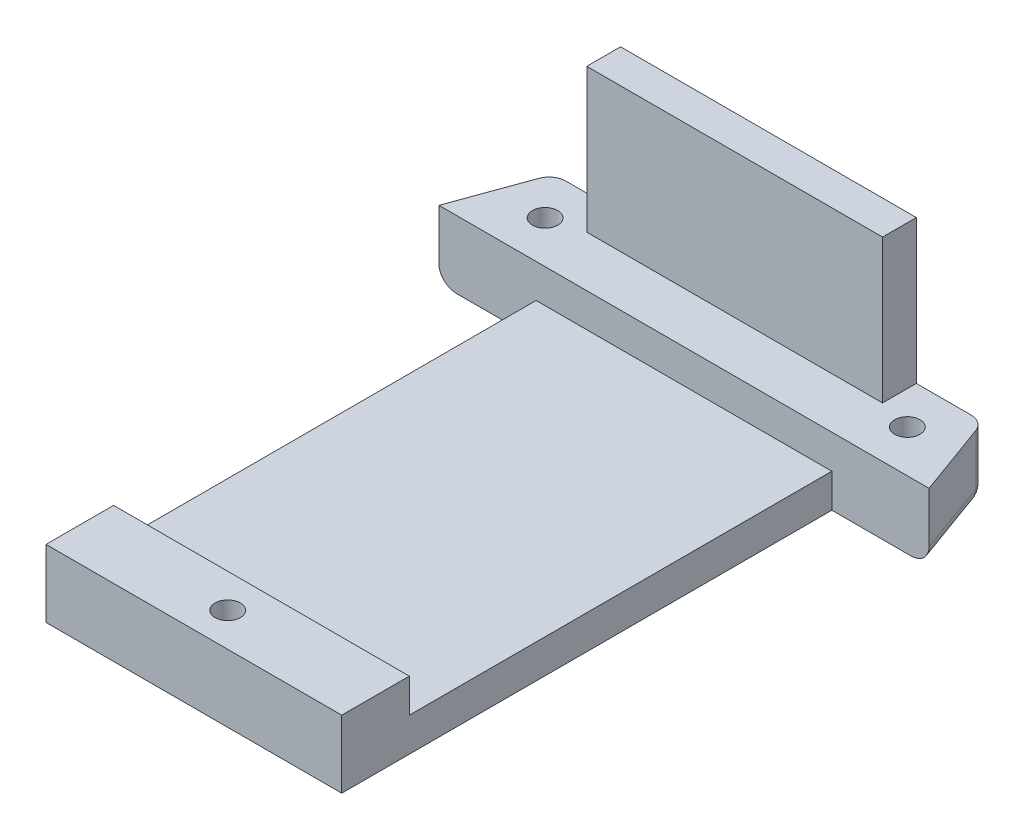
ISO-10303-21;
HEADER;
FILE_DESCRIPTION(('STEP AP214'),'2;1');
FILE_NAME('part.step','',(''),(''),'','','');
FILE_SCHEMA(('AUTOMOTIVE_DESIGN { 1 0 10303 214 1 1 1 1 }'));
ENDSEC;
DATA;
#1=APPLICATION_CONTEXT('core data for automotive mechanical design processes');
#2=APPLICATION_PROTOCOL_DEFINITION('international standard','automotive_design',2000,#1);
#3=PRODUCT_CONTEXT('',#1,'mechanical');
#4=PRODUCT('Part','Part','',(#3));
#5=PRODUCT_RELATED_PRODUCT_CATEGORY('part','',(#4));
#6=PRODUCT_DEFINITION_FORMATION('','',#4);
#7=PRODUCT_DEFINITION_CONTEXT('part definition',#1,'design');
#8=PRODUCT_DEFINITION('design','',#6,#7);
#9=PRODUCT_DEFINITION_SHAPE('','',#8);
#10=(LENGTH_UNIT() NAMED_UNIT(*) SI_UNIT(.MILLI.,.METRE.));
#11=(NAMED_UNIT(*) PLANE_ANGLE_UNIT() SI_UNIT($,.RADIAN.));
#12=(NAMED_UNIT(*) SI_UNIT($,.STERADIAN.) SOLID_ANGLE_UNIT());
#13=UNCERTAINTY_MEASURE_WITH_UNIT(LENGTH_MEASURE(1.E-05),#10,'distance_accuracy_value','');
#14=(GEOMETRIC_REPRESENTATION_CONTEXT(3) GLOBAL_UNCERTAINTY_ASSIGNED_CONTEXT((#13)) GLOBAL_UNIT_ASSIGNED_CONTEXT((#10,
#11,#12)) REPRESENTATION_CONTEXT('',''));
#15=CARTESIAN_POINT('',(0.,0.,0.));
#16=DIRECTION('',(0.,0.,1.));
#17=DIRECTION('',(1.,0.,0.));
#18=AXIS2_PLACEMENT_3D('',#15,#16,#17);
#19=CARTESIAN_POINT('',(0.,8.,34.));
#20=DIRECTION('',(0.,-1.,0.));
#21=DIRECTION('',(0.,0.,-1.));
#22=AXIS2_PLACEMENT_3D('',#19,#20,#21);
#23=CYLINDRICAL_SURFACE('',#22,1.5);
#24=CARTESIAN_POINT('',(0.,8.,34.));
#25=DIRECTION('',(0.,1.,0.));
#26=DIRECTION('',(0.,0.,1.));
#27=AXIS2_PLACEMENT_3D('',#24,#25,#26);
#28=CIRCLE('',#27,1.5);
#29=CARTESIAN_POINT('',(0.,8.,35.5));
#30=VERTEX_POINT('',#29);
#31=EDGE_CURVE('E284',#30,#30,#28,.T.);
#32=ORIENTED_EDGE('',*,*,#31,.T.);
#33=EDGE_LOOP('',(#32));
#34=FACE_BOUND('',#33,.T.);
#35=CARTESIAN_POINT('',(0.,4.,34.));
#36=DIRECTION('',(0.,-1.,0.));
#37=DIRECTION('',(0.,0.,-1.));
#38=AXIS2_PLACEMENT_3D('',#35,#36,#37);
#39=CIRCLE('',#38,1.5);
#40=CARTESIAN_POINT('',(0.,4.,32.5));
#41=VERTEX_POINT('',#40);
#42=EDGE_CURVE('E341',#41,#41,#39,.T.);
#43=ORIENTED_EDGE('',*,*,#42,.T.);
#44=EDGE_LOOP('',(#43));
#45=FACE_BOUND('',#44,.T.);
#46=ADVANCED_FACE('F43',(#34,#45),#23,.F.);
#47=CARTESIAN_POINT('',(-21.4375,8.,-25.));
#48=DIRECTION('',(0.,-1.,0.));
#49=DIRECTION('',(0.,0.,-1.));
#50=AXIS2_PLACEMENT_3D('',#47,#48,#49);
#51=CYLINDRICAL_SURFACE('',#50,1.5);
#52=CARTESIAN_POINT('',(-21.4375,8.,-25.));
#53=DIRECTION('',(0.,1.,0.));
#54=DIRECTION('',(0.,0.,1.));
#55=AXIS2_PLACEMENT_3D('',#52,#53,#54);
#56=CIRCLE('',#55,1.5);
#57=CARTESIAN_POINT('',(-21.4375,8.,-23.5));
#58=VERTEX_POINT('',#57);
#59=EDGE_CURVE('E256',#58,#58,#56,.T.);
#60=ORIENTED_EDGE('',*,*,#59,.T.);
#61=EDGE_LOOP('',(#60));
#62=FACE_BOUND('',#61,.T.);
#63=CARTESIAN_POINT('',(-21.4375,4.,-25.));
#64=DIRECTION('',(0.,-1.,0.));
#65=DIRECTION('',(0.,0.,-1.));
#66=AXIS2_PLACEMENT_3D('',#63,#64,#65);
#67=CIRCLE('',#66,1.5);
#68=CARTESIAN_POINT('',(-21.4375,4.,-26.5));
#69=VERTEX_POINT('',#68);
#70=EDGE_CURVE('E336',#69,#69,#67,.T.);
#71=ORIENTED_EDGE('',*,*,#70,.T.);
#72=EDGE_LOOP('',(#71));
#73=FACE_BOUND('',#72,.T.);
#74=ADVANCED_FACE('F492',(#62,#73),#51,.F.);
#75=CARTESIAN_POINT('',(21.4375,8.,-25.));
#76=DIRECTION('',(0.,-1.,0.));
#77=DIRECTION('',(0.,0.,-1.));
#78=AXIS2_PLACEMENT_3D('',#75,#76,#77);
#79=CYLINDRICAL_SURFACE('',#78,1.50000000000001);
#80=CARTESIAN_POINT('',(21.4375,8.,-25.));
#81=DIRECTION('',(0.,1.,0.));
#82=DIRECTION('',(0.,0.,1.));
#83=AXIS2_PLACEMENT_3D('',#80,#81,#82);
#84=CIRCLE('',#83,1.50000000000001);
#85=CARTESIAN_POINT('',(21.4375,8.,-23.5));
#86=VERTEX_POINT('',#85);
#87=EDGE_CURVE('E288',#86,#86,#84,.F.);
#88=ORIENTED_EDGE('',*,*,#87,.F.);
#89=EDGE_LOOP('',(#88));
#90=FACE_BOUND('',#89,.T.);
#91=CARTESIAN_POINT('',(21.4375,4.,-25.));
#92=DIRECTION('',(0.,-1.,0.));
#93=DIRECTION('',(0.,0.,-1.));
#94=AXIS2_PLACEMENT_3D('',#91,#92,#93);
#95=CIRCLE('',#94,1.50000000000001);
#96=CARTESIAN_POINT('',(21.4375,4.,-26.5));
#97=VERTEX_POINT('',#96);
#98=EDGE_CURVE('E332',#97,#97,#95,.F.);
#99=ORIENTED_EDGE('',*,*,#98,.F.);
#100=EDGE_LOOP('',(#99));
#101=FACE_BOUND('',#100,.T.);
#102=ADVANCED_FACE('F521',(#90,#101),#79,.F.);
#103=CARTESIAN_POINT('',(0.,8.,0.));
#104=DIRECTION('',(0.,1.,0.));
#105=DIRECTION('',(0.,0.,1.));
#106=AXIS2_PLACEMENT_3D('',#103,#104,#105);
#107=PLANE('',#106);
#108=DIRECTION('',(-0.3407993236214,0.,-0.940136065162483));
#109=VECTOR('',#108,1.);
#110=CARTESIAN_POINT('',(32.0397735119459,8.,-11.6144178980804));
#111=LINE('',#110,#109);
#112=CARTESIAN_POINT('',(29.,8.,-20.));
#113=VERTEX_POINT('',#112);
#114=CARTESIAN_POINT('',(25.8529204903745,8.,-28.6815986472428));
#115=VERTEX_POINT('',#114);
#116=EDGE_CURVE('E277',#113,#115,#111,.T.);
#117=ORIENTED_EDGE('',*,*,#116,.T.);
#118=CARTESIAN_POINT('',(23.9726483600495,8.,-28.));
#119=DIRECTION('',(0.,1.,0.));
#120=DIRECTION('',(0.,0.,1.));
#121=AXIS2_PLACEMENT_3D('',#118,#119,#120);
#122=CIRCLE('',#121,2.);
#123=CARTESIAN_POINT('',(23.9726483600495,8.,-30.));
#124=VERTEX_POINT('',#123);
#125=EDGE_CURVE('E53',#115,#124,#122,.T.);
#126=ORIENTED_EDGE('',*,*,#125,.T.);
#127=DIRECTION('',(-1.,0.,0.));
#128=VECTOR('',#127,1.);
#129=CARTESIAN_POINT('',(0.,8.,-30.));
#130=LINE('',#129,#128);
#131=CARTESIAN_POINT('',(17.5,8.,-30.));
#132=VERTEX_POINT('',#131);
#133=EDGE_CURVE('E281',#124,#132,#130,.T.);
#134=ORIENTED_EDGE('',*,*,#133,.T.);
#135=DIRECTION('',(0.,0.,-1.));
#136=VECTOR('',#135,1.);
#137=CARTESIAN_POINT('',(17.5,8.,-26.));
#138=LINE('',#137,#136);
#139=CARTESIAN_POINT('',(17.5,8.,-26.));
#140=VERTEX_POINT('',#139);
#141=EDGE_CURVE('E233',#140,#132,#138,.T.);
#142=ORIENTED_EDGE('',*,*,#141,.F.);
#143=DIRECTION('',(1.,0.,0.));
#144=VECTOR('',#143,1.);
#145=CARTESIAN_POINT('',(-17.5,8.,-26.));
#146=LINE('',#145,#144);
#147=CARTESIAN_POINT('',(-17.5,8.,-26.));
#148=VERTEX_POINT('',#147);
#149=EDGE_CURVE('E210',#148,#140,#146,.T.);
#150=ORIENTED_EDGE('',*,*,#149,.F.);
#151=DIRECTION('',(0.,0.,1.));
#152=VECTOR('',#151,1.);
#153=CARTESIAN_POINT('',(-17.5,8.,-30.));
#154=LINE('',#153,#152);
#155=CARTESIAN_POINT('',(-17.5,8.,-30.));
#156=VERTEX_POINT('',#155);
#157=EDGE_CURVE('E220',#156,#148,#154,.T.);
#158=ORIENTED_EDGE('',*,*,#157,.F.);
#159=CARTESIAN_POINT('',(-23.9726483600495,8.,-30.));
#160=VERTEX_POINT('',#159);
#161=EDGE_CURVE('E280',#156,#160,#130,.T.);
#162=ORIENTED_EDGE('',*,*,#161,.T.);
#163=CARTESIAN_POINT('',(-23.9726483600495,8.,-28.));
#164=DIRECTION('',(0.,1.,0.));
#165=DIRECTION('',(0.,0.,1.));
#166=AXIS2_PLACEMENT_3D('',#163,#164,#165);
#167=CIRCLE('',#166,2.);
#168=CARTESIAN_POINT('',(-25.8529204903745,8.,-28.6815986472428));
#169=VERTEX_POINT('',#168);
#170=EDGE_CURVE('E61',#160,#169,#167,.T.);
#171=ORIENTED_EDGE('',*,*,#170,.T.);
#172=DIRECTION('',(0.3407993236214,0.,-0.940136065162483));
#173=VECTOR('',#172,1.);
#174=CARTESIAN_POINT('',(-32.0397735119458,8.,-11.6144178980804));
#175=LINE('',#174,#173);
#176=CARTESIAN_POINT('',(-29.,8.,-20.));
#177=VERTEX_POINT('',#176);
#178=EDGE_CURVE('E260',#177,#169,#175,.T.);
#179=ORIENTED_EDGE('',*,*,#178,.F.);
#180=DIRECTION('',(-1.,0.,0.));
#181=VECTOR('',#180,1.);
#182=CARTESIAN_POINT('',(0.,8.,-20.));
#183=LINE('',#182,#181);
#184=EDGE_CURVE('E264',#113,#177,#183,.T.);
#185=ORIENTED_EDGE('',*,*,#184,.F.);
#186=EDGE_LOOP('',(#117,#126,#134,#142,#150,#158,#162,#171,#179,#185));
#187=FACE_BOUND('',#186,.T.);
#188=ORIENTED_EDGE('',*,*,#87,.T.);
#189=EDGE_LOOP('',(#188));
#190=FACE_BOUND('',#189,.T.);
#191=ORIENTED_EDGE('',*,*,#59,.F.);
#192=EDGE_LOOP('',(#191));
#193=FACE_BOUND('',#192,.T.);
#194=ADVANCED_FACE('F487',(#187,#190,#193),#107,.T.);
#195=CARTESIAN_POINT('',(-32.0397735119458,8.,-11.6144178980804));
#196=DIRECTION('',(-0.940136065162483,0.,-0.3407993236214));
#197=DIRECTION('',(-0.3407993236214,0.,0.940136065162483));
#198=AXIS2_PLACEMENT_3D('',#195,#196,#197);
#199=PLANE('',#198);
#200=ORIENTED_EDGE('',*,*,#178,.T.);
#201=DIRECTION('',(0.,-1.,0.));
#202=VECTOR('',#201,1.);
#203=CARTESIAN_POINT('',(-25.8529204903745,2.,-28.6815986472428));
#204=LINE('',#203,#202);
#205=CARTESIAN_POINT('',(-25.8529204903745,2.,-28.6815986472428));
#206=VERTEX_POINT('',#205);
#207=EDGE_CURVE('E11',#169,#206,#204,.T.);
#208=ORIENTED_EDGE('',*,*,#207,.T.);
#209=DIRECTION('',(0.3407993236214,0.,-0.940136065162483));
#210=VECTOR('',#209,1.);
#211=CARTESIAN_POINT('',(-29.,2.,-20.));
#212=LINE('',#211,#210);
#213=CARTESIAN_POINT('',(-29.,2.,-20.));
#214=VERTEX_POINT('',#213);
#215=EDGE_CURVE('E370',#206,#214,#212,.F.);
#216=ORIENTED_EDGE('',*,*,#215,.T.);
#217=DIRECTION('',(0.,-1.,0.));
#218=VECTOR('',#217,1.);
#219=CARTESIAN_POINT('',(-29.,8.,-20.));
#220=LINE('',#219,#218);
#221=EDGE_CURVE('E327',#177,#214,#220,.T.);
#222=ORIENTED_EDGE('',*,*,#221,.F.);
#223=EDGE_LOOP('',(#200,#208,#216,#222));
#224=FACE_BOUND('',#223,.T.);
#225=ADVANCED_FACE('F537',(#224),#199,.T.);
#226=CARTESIAN_POINT('',(-17.5,8.,0.));
#227=DIRECTION('',(1.,0.,0.));
#228=DIRECTION('',(0.,0.,-1.));
#229=AXIS2_PLACEMENT_3D('',#226,#227,#228);
#230=PLANE('',#229);
#231=DIRECTION('',(0.,0.,1.));
#232=VECTOR('',#231,1.);
#233=CARTESIAN_POINT('',(-17.5,8.,0.));
#234=LINE('',#233,#232);
#235=CARTESIAN_POINT('',(-17.5,8.,30.));
#236=VERTEX_POINT('',#235);
#237=CARTESIAN_POINT('',(-17.5,8.,38.));
#238=VERTEX_POINT('',#237);
#239=EDGE_CURVE('E205',#236,#238,#234,.T.);
#240=ORIENTED_EDGE('',*,*,#239,.F.);
#241=DIRECTION('',(0.,1.,0.));
#242=VECTOR('',#241,1.);
#243=CARTESIAN_POINT('',(-17.5,4.,30.));
#244=LINE('',#243,#242);
#245=CARTESIAN_POINT('',(-17.5,4.,30.));
#246=VERTEX_POINT('',#245);
#247=EDGE_CURVE('E183',#246,#236,#244,.T.);
#248=ORIENTED_EDGE('',*,*,#247,.F.);
#249=DIRECTION('',(0.,0.,1.));
#250=VECTOR('',#249,1.);
#251=CARTESIAN_POINT('',(-17.5,4.,30.));
#252=LINE('',#251,#250);
#253=CARTESIAN_POINT('',(-17.5,4.,-20.));
#254=VERTEX_POINT('',#253);
#255=EDGE_CURVE('E191',#254,#246,#252,.T.);
#256=ORIENTED_EDGE('',*,*,#255,.F.);
#257=DIRECTION('',(0.,-1.,0.));
#258=VECTOR('',#257,1.);
#259=CARTESIAN_POINT('',(-17.5,8.,-20.));
#260=LINE('',#259,#258);
#261=CARTESIAN_POINT('',(-17.5,0.,-20.));
#262=VERTEX_POINT('',#261);
#263=EDGE_CURVE('E324',#254,#262,#260,.T.);
#264=ORIENTED_EDGE('',*,*,#263,.T.);
#265=DIRECTION('',(0.,0.,1.));
#266=VECTOR('',#265,1.);
#267=CARTESIAN_POINT('',(-17.5,0.,0.));
#268=LINE('',#267,#266);
#269=CARTESIAN_POINT('',(-17.5,0.,38.));
#270=VERTEX_POINT('',#269);
#271=EDGE_CURVE('E296',#262,#270,#268,.T.);
#272=ORIENTED_EDGE('',*,*,#271,.T.);
#273=DIRECTION('',(0.,-1.,0.));
#274=VECTOR('',#273,1.);
#275=CARTESIAN_POINT('',(-17.5,8.,38.));
#276=LINE('',#275,#274);
#277=EDGE_CURVE('E320',#238,#270,#276,.T.);
#278=ORIENTED_EDGE('',*,*,#277,.F.);
#279=EDGE_LOOP('',(#240,#248,#256,#264,#272,#278));
#280=FACE_BOUND('',#279,.T.);
#281=ADVANCED_FACE('F203',(#280),#230,.F.);
#282=CARTESIAN_POINT('',(0.,8.,38.));
#283=DIRECTION('',(0.,0.,-1.));
#284=DIRECTION('',(-1.,0.,0.));
#285=AXIS2_PLACEMENT_3D('',#282,#283,#284);
#286=PLANE('',#285);
#287=DIRECTION('',(1.,0.,0.));
#288=VECTOR('',#287,1.);
#289=CARTESIAN_POINT('',(0.,0.,38.));
#290=LINE('',#289,#288);
#291=CARTESIAN_POINT('',(17.5,0.,38.));
#292=VERTEX_POINT('',#291);
#293=EDGE_CURVE('E300',#270,#292,#290,.T.);
#294=ORIENTED_EDGE('',*,*,#293,.T.);
#295=DIRECTION('',(0.,-1.,0.));
#296=VECTOR('',#295,1.);
#297=CARTESIAN_POINT('',(17.5,8.,38.));
#298=LINE('',#297,#296);
#299=CARTESIAN_POINT('',(17.5,8.,38.));
#300=VERTEX_POINT('',#299);
#301=EDGE_CURVE('E317',#300,#292,#298,.T.);
#302=ORIENTED_EDGE('',*,*,#301,.F.);
#303=DIRECTION('',(1.,0.,0.));
#304=VECTOR('',#303,1.);
#305=CARTESIAN_POINT('',(0.,8.,38.));
#306=LINE('',#305,#304);
#307=EDGE_CURVE('E270',#238,#300,#306,.T.);
#308=ORIENTED_EDGE('',*,*,#307,.F.);
#309=ORIENTED_EDGE('',*,*,#277,.T.);
#310=EDGE_LOOP('',(#294,#302,#308,#309));
#311=FACE_BOUND('',#310,.T.);
#312=ADVANCED_FACE('F455',(#311),#286,.F.);
#313=CARTESIAN_POINT('',(17.5,8.,0.));
#314=DIRECTION('',(1.,0.,0.));
#315=DIRECTION('',(0.,0.,-1.));
#316=AXIS2_PLACEMENT_3D('',#313,#314,#315);
#317=PLANE('',#316);
#318=DIRECTION('',(0.,1.,0.));
#319=VECTOR('',#318,1.);
#320=CARTESIAN_POINT('',(17.5,4.,30.));
#321=LINE('',#320,#319);
#322=CARTESIAN_POINT('',(17.5,4.,30.));
#323=VERTEX_POINT('',#322);
#324=CARTESIAN_POINT('',(17.5,8.,30.));
#325=VERTEX_POINT('',#324);
#326=EDGE_CURVE('E186',#323,#325,#321,.T.);
#327=ORIENTED_EDGE('',*,*,#326,.T.);
#328=DIRECTION('',(0.,0.,1.));
#329=VECTOR('',#328,1.);
#330=CARTESIAN_POINT('',(17.5,8.,0.));
#331=LINE('',#330,#329);
#332=EDGE_CURVE('E274',#325,#300,#331,.T.);
#333=ORIENTED_EDGE('',*,*,#332,.T.);
#334=ORIENTED_EDGE('',*,*,#301,.T.);
#335=DIRECTION('',(0.,0.,1.));
#336=VECTOR('',#335,1.);
#337=CARTESIAN_POINT('',(17.5,0.,0.));
#338=LINE('',#337,#336);
#339=CARTESIAN_POINT('',(17.5,0.,-20.));
#340=VERTEX_POINT('',#339);
#341=EDGE_CURVE('E304',#340,#292,#338,.T.);
#342=ORIENTED_EDGE('',*,*,#341,.F.);
#343=DIRECTION('',(0.,-1.,0.));
#344=VECTOR('',#343,1.);
#345=CARTESIAN_POINT('',(17.5,8.,-20.));
#346=LINE('',#345,#344);
#347=CARTESIAN_POINT('',(17.5,4.,-20.));
#348=VERTEX_POINT('',#347);
#349=EDGE_CURVE('E314',#348,#340,#346,.T.);
#350=ORIENTED_EDGE('',*,*,#349,.F.);
#351=DIRECTION('',(0.,0.,-1.));
#352=VECTOR('',#351,1.);
#353=CARTESIAN_POINT('',(17.5,4.,-20.));
#354=LINE('',#353,#352);
#355=EDGE_CURVE('E190',#323,#348,#354,.T.);
#356=ORIENTED_EDGE('',*,*,#355,.F.);
#357=EDGE_LOOP('',(#327,#333,#334,#342,#350,#356));
#358=FACE_BOUND('',#357,.T.);
#359=ADVANCED_FACE('F450',(#358),#317,.T.);
#360=CARTESIAN_POINT('',(0.,8.,-20.));
#361=DIRECTION('',(0.,0.,-1.));
#362=DIRECTION('',(-1.,0.,0.));
#363=AXIS2_PLACEMENT_3D('',#360,#361,#362);
#364=PLANE('',#363);
#365=DIRECTION('',(1.,0.,0.));
#366=VECTOR('',#365,1.);
#367=CARTESIAN_POINT('',(0.,0.,-20.));
#368=LINE('',#367,#366);
#369=CARTESIAN_POINT('',(26.8726483600495,0.,-20.));
#370=VERTEX_POINT('',#369);
#371=EDGE_CURVE('E261',#340,#370,#368,.T.);
#372=ORIENTED_EDGE('',*,*,#371,.T.);
#373=CARTESIAN_POINT('',(26.8726483600495,2.,-20.));
#374=DIRECTION('',(0.,0.,-1.));
#375=DIRECTION('',(-1.,0.,0.));
#376=AXIS2_PLACEMENT_3D('',#373,#374,#375);
#377=ELLIPSE('',#376,2.12735163995048,2.);
#378=CARTESIAN_POINT('',(29.,2.,-20.));
#379=VERTEX_POINT('',#378);
#380=EDGE_CURVE('E367',#370,#379,#377,.F.);
#381=ORIENTED_EDGE('',*,*,#380,.T.);
#382=DIRECTION('',(0.,-1.,0.));
#383=VECTOR('',#382,1.);
#384=CARTESIAN_POINT('',(29.,8.,-20.));
#385=LINE('',#384,#383);
#386=EDGE_CURVE('E292',#113,#379,#385,.T.);
#387=ORIENTED_EDGE('',*,*,#386,.F.);
#388=ORIENTED_EDGE('',*,*,#184,.T.);
#389=ORIENTED_EDGE('',*,*,#221,.T.);
#390=CARTESIAN_POINT('',(-26.8726483600495,2.,-20.));
#391=DIRECTION('',(0.,0.,-1.));
#392=DIRECTION('',(-1.,0.,0.));
#393=AXIS2_PLACEMENT_3D('',#390,#391,#392);
#394=ELLIPSE('',#393,2.12735163995048,2.);
#395=CARTESIAN_POINT('',(-26.8726483600495,0.,-20.));
#396=VERTEX_POINT('',#395);
#397=EDGE_CURVE('E364',#214,#396,#394,.F.);
#398=ORIENTED_EDGE('',*,*,#397,.T.);
#399=DIRECTION('',(-1.,0.,0.));
#400=VECTOR('',#399,1.);
#401=CARTESIAN_POINT('',(0.,0.,-20.));
#402=LINE('',#401,#400);
#403=EDGE_CURVE('E255',#262,#396,#402,.T.);
#404=ORIENTED_EDGE('',*,*,#403,.F.);
#405=ORIENTED_EDGE('',*,*,#263,.F.);
#406=DIRECTION('',(-1.,0.,0.));
#407=VECTOR('',#406,1.);
#408=CARTESIAN_POINT('',(-17.5,4.,-20.));
#409=LINE('',#408,#407);
#410=EDGE_CURVE('E196',#348,#254,#409,.T.);
#411=ORIENTED_EDGE('',*,*,#410,.F.);
#412=ORIENTED_EDGE('',*,*,#349,.T.);
#413=EDGE_LOOP('',(#372,#381,#387,#388,#389,#398,#404,#405,#411,#412));
#414=FACE_BOUND('',#413,.T.);
#415=ADVANCED_FACE('F443',(#414),#364,.F.);
#416=CARTESIAN_POINT('',(32.0397735119459,8.,-11.6144178980804));
#417=DIRECTION('',(-0.940136065162483,0.,0.3407993236214));
#418=DIRECTION('',(0.3407993236214,0.,0.940136065162483));
#419=AXIS2_PLACEMENT_3D('',#416,#417,#418);
#420=PLANE('',#419);
#421=DIRECTION('',(-0.3407993236214,0.,-0.940136065162483));
#422=VECTOR('',#421,1.);
#423=CARTESIAN_POINT('',(32.0397735119459,2.,-11.6144178980804));
#424=LINE('',#423,#422);
#425=CARTESIAN_POINT('',(25.8529204903745,2.,-28.6815986472428));
#426=VERTEX_POINT('',#425);
#427=EDGE_CURVE('E331',#379,#426,#424,.T.);
#428=ORIENTED_EDGE('',*,*,#427,.T.);
#429=DIRECTION('',(0.,-1.,0.));
#430=VECTOR('',#429,1.);
#431=CARTESIAN_POINT('',(25.8529204903745,8.,-28.6815986472428));
#432=LINE('',#431,#430);
#433=EDGE_CURVE('E69',#426,#115,#432,.F.);
#434=ORIENTED_EDGE('',*,*,#433,.T.);
#435=ORIENTED_EDGE('',*,*,#116,.F.);
#436=ORIENTED_EDGE('',*,*,#386,.T.);
#437=EDGE_LOOP('',(#428,#434,#435,#436));
#438=FACE_BOUND('',#437,.T.);
#439=ADVANCED_FACE('F440',(#438),#420,.F.);
#440=CARTESIAN_POINT('',(0.,8.,-30.));
#441=DIRECTION('',(0.,0.,1.));
#442=DIRECTION('',(1.,0.,0.));
#443=AXIS2_PLACEMENT_3D('',#440,#441,#442);
#444=PLANE('',#443);
#445=ORIENTED_EDGE('',*,*,#133,.F.);
#446=DIRECTION('',(0.,-1.,0.));
#447=VECTOR('',#446,1.);
#448=CARTESIAN_POINT('',(23.9726483600495,8.,-30.));
#449=LINE('',#448,#447);
#450=CARTESIAN_POINT('',(23.9726483600495,2.,-30.));
#451=VERTEX_POINT('',#450);
#452=EDGE_CURVE('E394',#124,#451,#449,.T.);
#453=ORIENTED_EDGE('',*,*,#452,.T.);
#454=DIRECTION('',(-1.,0.,0.));
#455=VECTOR('',#454,1.);
#456=CARTESIAN_POINT('',(0.,2.,-30.));
#457=LINE('',#456,#455);
#458=CARTESIAN_POINT('',(-23.9726483600495,2.,-30.));
#459=VERTEX_POINT('',#458);
#460=EDGE_CURVE('E373',#451,#459,#457,.T.);
#461=ORIENTED_EDGE('',*,*,#460,.T.);
#462=DIRECTION('',(0.,-1.,0.));
#463=VECTOR('',#462,1.);
#464=CARTESIAN_POINT('',(-23.9726483600495,8.,-30.));
#465=LINE('',#464,#463);
#466=EDGE_CURVE('E391',#459,#160,#465,.F.);
#467=ORIENTED_EDGE('',*,*,#466,.T.);
#468=ORIENTED_EDGE('',*,*,#161,.F.);
#469=DIRECTION('',(0.,-1.,0.));
#470=VECTOR('',#469,1.);
#471=CARTESIAN_POINT('',(-17.5,25.,-30.));
#472=LINE('',#471,#470);
#473=CARTESIAN_POINT('',(-17.5,25.,-30.));
#474=VERTEX_POINT('',#473);
#475=EDGE_CURVE('E243',#474,#156,#472,.T.);
#476=ORIENTED_EDGE('',*,*,#475,.F.);
#477=DIRECTION('',(-1.,0.,0.));
#478=VECTOR('',#477,1.);
#479=CARTESIAN_POINT('',(17.5,25.,-30.));
#480=LINE('',#479,#478);
#481=CARTESIAN_POINT('',(17.5,25.,-30.));
#482=VERTEX_POINT('',#481);
#483=EDGE_CURVE('E223',#482,#474,#480,.T.);
#484=ORIENTED_EDGE('',*,*,#483,.F.);
#485=DIRECTION('',(0.,-1.,0.));
#486=VECTOR('',#485,1.);
#487=CARTESIAN_POINT('',(17.5,25.,-30.));
#488=LINE('',#487,#486);
#489=EDGE_CURVE('E247',#482,#132,#488,.T.);
#490=ORIENTED_EDGE('',*,*,#489,.T.);
#491=EDGE_LOOP('',(#445,#453,#461,#467,#468,#476,#484,#490));
#492=FACE_BOUND('',#491,.T.);
#493=ADVANCED_FACE('F430',(#492),#444,.F.);
#494=DIRECTION('',(1.,0.,0.));
#495=VECTOR('',#494,1.);
#496=CARTESIAN_POINT('',(17.5,8.,30.));
#497=LINE('',#496,#495);
#498=EDGE_CURVE('E200',#236,#325,#497,.T.);
#499=ORIENTED_EDGE('',*,*,#498,.F.);
#500=ORIENTED_EDGE('',*,*,#239,.T.);
#501=ORIENTED_EDGE('',*,*,#307,.T.);
#502=ORIENTED_EDGE('',*,*,#332,.F.);
#503=EDGE_LOOP('',(#499,#500,#501,#502));
#504=FACE_BOUND('',#503,.T.);
#505=ORIENTED_EDGE('',*,*,#31,.F.);
#506=EDGE_LOOP('',(#505));
#507=FACE_BOUND('',#506,.T.);
#508=ADVANCED_FACE('F483',(#504,#507),#107,.T.);
#509=CARTESIAN_POINT('',(0.,0.,0.));
#510=DIRECTION('',(0.,1.,0.));
#511=DIRECTION('',(0.,0.,1.));
#512=AXIS2_PLACEMENT_3D('',#509,#510,#511);
#513=PLANE('',#512);
#514=CARTESIAN_POINT('',(0.,0.,34.));
#515=DIRECTION('',(0.,-1.,0.));
#516=DIRECTION('',(0.,0.,-1.));
#517=AXIS2_PLACEMENT_3D('',#514,#515,#516);
#518=CIRCLE('',#517,3.);
#519=CARTESIAN_POINT('',(0.,0.,31.));
#520=VERTEX_POINT('',#519);
#521=EDGE_CURVE('E474',#520,#520,#518,.T.);
#522=ORIENTED_EDGE('',*,*,#521,.F.);
#523=EDGE_LOOP('',(#522));
#524=FACE_BOUND('',#523,.T.);
#525=DIRECTION('',(-1.,0.,0.));
#526=VECTOR('',#525,1.);
#527=CARTESIAN_POINT('',(0.,0.,-28.));
#528=LINE('',#527,#526);
#529=CARTESIAN_POINT('',(21.4375,0.,-28.));
#530=VERTEX_POINT('',#529);
#531=CARTESIAN_POINT('',(23.9726483600495,0.,-28.));
#532=VERTEX_POINT('',#531);
#533=EDGE_CURVE('E347',#530,#532,#528,.F.);
#534=ORIENTED_EDGE('',*,*,#533,.T.);
#535=DIRECTION('',(-0.3407993236214,0.,-0.940136065162483));
#536=VECTOR('',#535,1.);
#537=CARTESIAN_POINT('',(30.1595013816209,0.,-10.9328192508376));
#538=LINE('',#537,#536);
#539=EDGE_CURVE('E361',#532,#370,#538,.F.);
#540=ORIENTED_EDGE('',*,*,#539,.T.);
#541=ORIENTED_EDGE('',*,*,#371,.F.);
#542=ORIENTED_EDGE('',*,*,#341,.T.);
#543=ORIENTED_EDGE('',*,*,#293,.F.);
#544=ORIENTED_EDGE('',*,*,#271,.F.);
#545=ORIENTED_EDGE('',*,*,#403,.T.);
#546=DIRECTION('',(0.3407993236214,0.,-0.940136065162483));
#547=VECTOR('',#546,1.);
#548=CARTESIAN_POINT('',(-23.494727869675,0.,-29.3184013527572));
#549=LINE('',#548,#547);
#550=CARTESIAN_POINT('',(-23.9726483600495,0.,-28.));
#551=VERTEX_POINT('',#550);
#552=EDGE_CURVE('E357',#396,#551,#549,.T.);
#553=ORIENTED_EDGE('',*,*,#552,.T.);
#554=DIRECTION('',(-1.,0.,0.));
#555=VECTOR('',#554,1.);
#556=CARTESIAN_POINT('',(0.,0.,-28.));
#557=LINE('',#556,#555);
#558=CARTESIAN_POINT('',(-21.4375,0.,-28.));
#559=VERTEX_POINT('',#558);
#560=EDGE_CURVE('E354',#551,#559,#557,.F.);
#561=ORIENTED_EDGE('',*,*,#560,.T.);
#562=CARTESIAN_POINT('',(-21.4375,0.,-25.));
#563=DIRECTION('',(0.,-1.,0.));
#564=DIRECTION('',(0.,0.,-1.));
#565=AXIS2_PLACEMENT_3D('',#562,#563,#564);
#566=CIRCLE('',#565,3.);
#567=EDGE_CURVE('E465',#559,#559,#566,.T.);
#568=ORIENTED_EDGE('',*,*,#567,.F.);
#569=DIRECTION('',(-1.,0.,0.));
#570=VECTOR('',#569,1.);
#571=CARTESIAN_POINT('',(0.,0.,-28.));
#572=LINE('',#571,#570);
#573=EDGE_CURVE('E351',#559,#530,#572,.F.);
#574=ORIENTED_EDGE('',*,*,#573,.T.);
#575=CARTESIAN_POINT('',(21.4375,0.,-25.));
#576=DIRECTION('',(0.,-1.,0.));
#577=DIRECTION('',(0.,0.,-1.));
#578=AXIS2_PLACEMENT_3D('',#575,#576,#577);
#579=CIRCLE('',#578,3.);
#580=EDGE_CURVE('E404',#530,#530,#579,.T.);
#581=ORIENTED_EDGE('',*,*,#580,.F.);
#582=EDGE_LOOP('',(#534,#540,#541,#542,#543,#544,#545,#553,#561,#568,#574,#581));
#583=FACE_BOUND('',#582,.T.);
#584=ADVANCED_FACE('F448',(#524,#583),#513,.F.);
#585=CARTESIAN_POINT('',(-17.5,25.,-26.));
#586=DIRECTION('',(0.,0.,-1.));
#587=DIRECTION('',(-1.,0.,0.));
#588=AXIS2_PLACEMENT_3D('',#585,#586,#587);
#589=PLANE('',#588);
#590=ORIENTED_EDGE('',*,*,#149,.T.);
#591=DIRECTION('',(0.,-1.,0.));
#592=VECTOR('',#591,1.);
#593=CARTESIAN_POINT('',(17.5,25.,-26.));
#594=LINE('',#593,#592);
#595=CARTESIAN_POINT('',(17.5,25.,-26.));
#596=VERTEX_POINT('',#595);
#597=EDGE_CURVE('E251',#596,#140,#594,.T.);
#598=ORIENTED_EDGE('',*,*,#597,.F.);
#599=DIRECTION('',(1.,0.,0.));
#600=VECTOR('',#599,1.);
#601=CARTESIAN_POINT('',(-17.5,25.,-26.));
#602=LINE('',#601,#600);
#603=CARTESIAN_POINT('',(-17.5,25.,-26.));
#604=VERTEX_POINT('',#603);
#605=EDGE_CURVE('E215',#604,#596,#602,.T.);
#606=ORIENTED_EDGE('',*,*,#605,.F.);
#607=DIRECTION('',(0.,-1.,0.));
#608=VECTOR('',#607,1.);
#609=CARTESIAN_POINT('',(-17.5,25.,-26.));
#610=LINE('',#609,#608);
#611=EDGE_CURVE('E229',#604,#148,#610,.T.);
#612=ORIENTED_EDGE('',*,*,#611,.T.);
#613=EDGE_LOOP('',(#590,#598,#606,#612));
#614=FACE_BOUND('',#613,.T.);
#615=ADVANCED_FACE('F512',(#614),#589,.F.);
#616=CARTESIAN_POINT('',(17.5,25.,-26.));
#617=DIRECTION('',(-1.,0.,0.));
#618=DIRECTION('',(0.,0.,1.));
#619=AXIS2_PLACEMENT_3D('',#616,#617,#618);
#620=PLANE('',#619);
#621=ORIENTED_EDGE('',*,*,#141,.T.);
#622=ORIENTED_EDGE('',*,*,#489,.F.);
#623=DIRECTION('',(0.,0.,-1.));
#624=VECTOR('',#623,1.);
#625=CARTESIAN_POINT('',(17.5,25.,-26.));
#626=LINE('',#625,#624);
#627=EDGE_CURVE('E219',#596,#482,#626,.T.);
#628=ORIENTED_EDGE('',*,*,#627,.F.);
#629=ORIENTED_EDGE('',*,*,#597,.T.);
#630=EDGE_LOOP('',(#621,#622,#628,#629));
#631=FACE_BOUND('',#630,.T.);
#632=ADVANCED_FACE('F517',(#631),#620,.F.);
#633=CARTESIAN_POINT('',(-17.5,25.,-30.));
#634=DIRECTION('',(1.,0.,0.));
#635=DIRECTION('',(0.,0.,-1.));
#636=AXIS2_PLACEMENT_3D('',#633,#634,#635);
#637=PLANE('',#636);
#638=ORIENTED_EDGE('',*,*,#157,.T.);
#639=ORIENTED_EDGE('',*,*,#611,.F.);
#640=DIRECTION('',(0.,0.,1.));
#641=VECTOR('',#640,1.);
#642=CARTESIAN_POINT('',(-17.5,25.,-30.));
#643=LINE('',#642,#641);
#644=EDGE_CURVE('E226',#474,#604,#643,.T.);
#645=ORIENTED_EDGE('',*,*,#644,.F.);
#646=ORIENTED_EDGE('',*,*,#475,.T.);
#647=EDGE_LOOP('',(#638,#639,#645,#646));
#648=FACE_BOUND('',#647,.T.);
#649=ADVANCED_FACE('F645',(#648),#637,.F.);
#650=CARTESIAN_POINT('',(0.,25.,0.));
#651=DIRECTION('',(0.,1.,0.));
#652=DIRECTION('',(0.,0.,1.));
#653=AXIS2_PLACEMENT_3D('',#650,#651,#652);
#654=PLANE('',#653);
#655=ORIENTED_EDGE('',*,*,#605,.T.);
#656=ORIENTED_EDGE('',*,*,#627,.T.);
#657=ORIENTED_EDGE('',*,*,#483,.T.);
#658=ORIENTED_EDGE('',*,*,#644,.T.);
#659=EDGE_LOOP('',(#655,#656,#657,#658));
#660=FACE_BOUND('',#659,.T.);
#661=ADVANCED_FACE('F637',(#660),#654,.T.);
#662=CARTESIAN_POINT('',(17.5,4.,30.));
#663=DIRECTION('',(0.,0.,1.));
#664=DIRECTION('',(1.,0.,0.));
#665=AXIS2_PLACEMENT_3D('',#662,#663,#664);
#666=PLANE('',#665);
#667=ORIENTED_EDGE('',*,*,#498,.T.);
#668=ORIENTED_EDGE('',*,*,#326,.F.);
#669=DIRECTION('',(1.,0.,0.));
#670=VECTOR('',#669,1.);
#671=CARTESIAN_POINT('',(17.5,4.,30.));
#672=LINE('',#671,#670);
#673=EDGE_CURVE('E179',#246,#323,#672,.T.);
#674=ORIENTED_EDGE('',*,*,#673,.F.);
#675=ORIENTED_EDGE('',*,*,#247,.T.);
#676=EDGE_LOOP('',(#667,#668,#674,#675));
#677=FACE_BOUND('',#676,.T.);
#678=ADVANCED_FACE('F181',(#677),#666,.F.);
#679=CARTESIAN_POINT('',(0.,4.,0.));
#680=DIRECTION('',(0.,-1.,0.));
#681=DIRECTION('',(0.,0.,-1.));
#682=AXIS2_PLACEMENT_3D('',#679,#680,#681);
#683=PLANE('',#682);
#684=ORIENTED_EDGE('',*,*,#255,.T.);
#685=ORIENTED_EDGE('',*,*,#673,.T.);
#686=ORIENTED_EDGE('',*,*,#355,.T.);
#687=ORIENTED_EDGE('',*,*,#410,.T.);
#688=EDGE_LOOP('',(#684,#685,#686,#687));
#689=FACE_BOUND('',#688,.T.);
#690=ADVANCED_FACE('F194',(#689),#683,.F.);
#691=CARTESIAN_POINT('',(21.4375,4.,-25.));
#692=DIRECTION('',(0.,-1.,0.));
#693=DIRECTION('',(0.,0.,-1.));
#694=AXIS2_PLACEMENT_3D('',#691,#692,#693);
#695=PLANE('',#694);
#696=CARTESIAN_POINT('',(21.4375,4.,-25.));
#697=DIRECTION('',(0.,-1.,0.));
#698=DIRECTION('',(0.,0.,-1.));
#699=AXIS2_PLACEMENT_3D('',#696,#697,#698);
#700=CIRCLE('',#699,3.);
#701=CARTESIAN_POINT('',(21.4375,4.,-28.));
#702=VERTEX_POINT('',#701);
#703=EDGE_CURVE('E412',#702,#702,#700,.T.);
#704=ORIENTED_EDGE('',*,*,#703,.T.);
#705=EDGE_LOOP('',(#704));
#706=FACE_BOUND('',#705,.T.);
#707=ORIENTED_EDGE('',*,*,#98,.T.);
#708=EDGE_LOOP('',(#707));
#709=FACE_BOUND('',#708,.T.);
#710=ADVANCED_FACE('F615',(#706,#709),#695,.T.);
#711=CARTESIAN_POINT('',(21.4375,4.,-25.));
#712=DIRECTION('',(0.,-1.,0.));
#713=DIRECTION('',(0.,0.,-1.));
#714=AXIS2_PLACEMENT_3D('',#711,#712,#713);
#715=CYLINDRICAL_SURFACE('',#714,3.);
#716=ORIENTED_EDGE('',*,*,#703,.F.);
#717=EDGE_LOOP('',(#716));
#718=FACE_BOUND('',#717,.T.);
#719=ORIENTED_EDGE('',*,*,#580,.T.);
#720=EDGE_LOOP('',(#719));
#721=FACE_BOUND('',#720,.T.);
#722=ADVANCED_FACE('F606',(#718,#721),#715,.F.);
#723=CARTESIAN_POINT('',(-21.4375,4.,-25.));
#724=DIRECTION('',(0.,-1.,0.));
#725=DIRECTION('',(0.,0.,-1.));
#726=AXIS2_PLACEMENT_3D('',#723,#724,#725);
#727=CYLINDRICAL_SURFACE('',#726,3.);
#728=CARTESIAN_POINT('',(-21.4375,4.,-25.));
#729=DIRECTION('',(0.,-1.,0.));
#730=DIRECTION('',(0.,0.,-1.));
#731=AXIS2_PLACEMENT_3D('',#728,#729,#730);
#732=CIRCLE('',#731,3.);
#733=CARTESIAN_POINT('',(-21.4375,4.,-28.));
#734=VERTEX_POINT('',#733);
#735=EDGE_CURVE('E469',#734,#734,#732,.T.);
#736=ORIENTED_EDGE('',*,*,#735,.F.);
#737=EDGE_LOOP('',(#736));
#738=FACE_BOUND('',#737,.T.);
#739=ORIENTED_EDGE('',*,*,#567,.T.);
#740=EDGE_LOOP('',(#739));
#741=FACE_BOUND('',#740,.T.);
#742=ADVANCED_FACE('F467',(#738,#741),#727,.F.);
#743=CARTESIAN_POINT('',(-21.4375,4.,-25.));
#744=DIRECTION('',(0.,-1.,0.));
#745=DIRECTION('',(0.,0.,-1.));
#746=AXIS2_PLACEMENT_3D('',#743,#744,#745);
#747=PLANE('',#746);
#748=ORIENTED_EDGE('',*,*,#70,.F.);
#749=EDGE_LOOP('',(#748));
#750=FACE_BOUND('',#749,.T.);
#751=ORIENTED_EDGE('',*,*,#735,.T.);
#752=EDGE_LOOP('',(#751));
#753=FACE_BOUND('',#752,.T.);
#754=ADVANCED_FACE('F591',(#750,#753),#747,.T.);
#755=CARTESIAN_POINT('',(0.,4.,34.));
#756=DIRECTION('',(0.,-1.,0.));
#757=DIRECTION('',(0.,0.,-1.));
#758=AXIS2_PLACEMENT_3D('',#755,#756,#757);
#759=CYLINDRICAL_SURFACE('',#758,3.);
#760=CARTESIAN_POINT('',(0.,4.,34.));
#761=DIRECTION('',(0.,-1.,0.));
#762=DIRECTION('',(0.,0.,-1.));
#763=AXIS2_PLACEMENT_3D('',#760,#761,#762);
#764=CIRCLE('',#763,3.);
#765=CARTESIAN_POINT('',(0.,4.,31.));
#766=VERTEX_POINT('',#765);
#767=EDGE_CURVE('E337',#766,#766,#764,.T.);
#768=ORIENTED_EDGE('',*,*,#767,.F.);
#769=EDGE_LOOP('',(#768));
#770=FACE_BOUND('',#769,.T.);
#771=ORIENTED_EDGE('',*,*,#521,.T.);
#772=EDGE_LOOP('',(#771));
#773=FACE_BOUND('',#772,.T.);
#774=ADVANCED_FACE('F499',(#770,#773),#759,.F.);
#775=CARTESIAN_POINT('',(0.,4.,34.));
#776=DIRECTION('',(0.,-1.,0.));
#777=DIRECTION('',(0.,0.,-1.));
#778=AXIS2_PLACEMENT_3D('',#775,#776,#777);
#779=PLANE('',#778);
#780=ORIENTED_EDGE('',*,*,#42,.F.);
#781=EDGE_LOOP('',(#780));
#782=FACE_BOUND('',#781,.T.);
#783=ORIENTED_EDGE('',*,*,#767,.T.);
#784=EDGE_LOOP('',(#783));
#785=FACE_BOUND('',#784,.T.);
#786=ADVANCED_FACE('F496',(#782,#785),#779,.T.);
#787=CARTESIAN_POINT('',(-30.1595013816209,2.,-10.9328192508376));
#788=DIRECTION('',(-0.3407993236214,0.,0.940136065162483));
#789=DIRECTION('',(0.940136065162483,0.,0.3407993236214));
#790=AXIS2_PLACEMENT_3D('',#787,#788,#789);
#791=CYLINDRICAL_SURFACE('',#790,2.);
#792=ORIENTED_EDGE('',*,*,#215,.F.);
#793=CARTESIAN_POINT('',(-23.9726483600495,2.,-28.));
#794=DIRECTION('',(-0.3407993236214,0.,0.940136065162483));
#795=DIRECTION('',(0.940136065162483,0.,0.3407993236214));
#796=AXIS2_PLACEMENT_3D('',#793,#794,#795);
#797=CIRCLE('',#796,2.);
#798=EDGE_CURVE('E388',#206,#551,#797,.T.);
#799=ORIENTED_EDGE('',*,*,#798,.T.);
#800=ORIENTED_EDGE('',*,*,#552,.F.);
#801=ORIENTED_EDGE('',*,*,#397,.F.);
#802=EDGE_LOOP('',(#792,#799,#800,#801));
#803=FACE_BOUND('',#802,.T.);
#804=ADVANCED_FACE('F462',(#803),#791,.T.);
#805=CARTESIAN_POINT('',(0.,2.,-28.));
#806=DIRECTION('',(-1.,0.,0.));
#807=DIRECTION('',(0.,0.,1.));
#808=AXIS2_PLACEMENT_3D('',#805,#806,#807);
#809=CYLINDRICAL_SURFACE('',#808,2.);
#810=ORIENTED_EDGE('',*,*,#460,.F.);
#811=CARTESIAN_POINT('',(23.9726483600495,2.,-28.));
#812=DIRECTION('',(-1.,0.,0.));
#813=DIRECTION('',(0.,0.,1.));
#814=AXIS2_PLACEMENT_3D('',#811,#812,#813);
#815=CIRCLE('',#814,2.);
#816=EDGE_CURVE('E385',#451,#532,#815,.T.);
#817=ORIENTED_EDGE('',*,*,#816,.T.);
#818=ORIENTED_EDGE('',*,*,#533,.F.);
#819=ORIENTED_EDGE('',*,*,#573,.F.);
#820=ORIENTED_EDGE('',*,*,#560,.F.);
#821=CARTESIAN_POINT('',(-23.9726483600495,2.,-28.));
#822=DIRECTION('',(-1.,0.,0.));
#823=DIRECTION('',(0.,0.,1.));
#824=AXIS2_PLACEMENT_3D('',#821,#822,#823);
#825=CIRCLE('',#824,2.);
#826=EDGE_CURVE('E381',#551,#459,#825,.F.);
#827=ORIENTED_EDGE('',*,*,#826,.T.);
#828=EDGE_LOOP('',(#810,#817,#818,#819,#820,#827));
#829=FACE_BOUND('',#828,.T.);
#830=ADVANCED_FACE('F427',(#829),#809,.T.);
#831=CARTESIAN_POINT('',(30.1595013816209,2.,-10.9328192508376));
#832=DIRECTION('',(-0.3407993236214,0.,-0.940136065162483));
#833=DIRECTION('',(-0.940136065162483,0.,0.3407993236214));
#834=AXIS2_PLACEMENT_3D('',#831,#832,#833);
#835=CYLINDRICAL_SURFACE('',#834,2.);
#836=ORIENTED_EDGE('',*,*,#539,.F.);
#837=CARTESIAN_POINT('',(23.9726483600495,2.,-28.));
#838=DIRECTION('',(-0.3407993236214,0.,-0.940136065162483));
#839=DIRECTION('',(-0.940136065162483,0.,0.3407993236214));
#840=AXIS2_PLACEMENT_3D('',#837,#838,#839);
#841=CIRCLE('',#840,2.);
#842=EDGE_CURVE('E377',#532,#426,#841,.F.);
#843=ORIENTED_EDGE('',*,*,#842,.T.);
#844=ORIENTED_EDGE('',*,*,#427,.F.);
#845=ORIENTED_EDGE('',*,*,#380,.F.);
#846=EDGE_LOOP('',(#836,#843,#844,#845));
#847=FACE_BOUND('',#846,.T.);
#848=ADVANCED_FACE('F438',(#847),#835,.T.);
#849=CARTESIAN_POINT('',(23.9726483600495,8.,-28.));
#850=DIRECTION('',(0.,-1.,0.));
#851=DIRECTION('',(0.,0.,-1.));
#852=AXIS2_PLACEMENT_3D('',#849,#850,#851);
#853=CYLINDRICAL_SURFACE('',#852,2.);
#854=ORIENTED_EDGE('',*,*,#125,.F.);
#855=ORIENTED_EDGE('',*,*,#433,.F.);
#856=CARTESIAN_POINT('',(23.9726483600495,2.,-28.));
#857=DIRECTION('',(0.,-1.,0.));
#858=DIRECTION('',(0.,0.,-1.));
#859=AXIS2_PLACEMENT_3D('',#856,#857,#858);
#860=CIRCLE('',#859,2.);
#861=EDGE_CURVE('E402',#451,#426,#860,.T.);
#862=ORIENTED_EDGE('',*,*,#861,.F.);
#863=ORIENTED_EDGE('',*,*,#452,.F.);
#864=EDGE_LOOP('',(#854,#855,#862,#863));
#865=FACE_BOUND('',#864,.T.);
#866=ADVANCED_FACE('F434',(#865),#853,.T.);
#867=CARTESIAN_POINT('',(23.9726483600495,2.,-28.));
#868=DIRECTION('',(0.,0.,1.));
#869=DIRECTION('',(1.,0.,0.));
#870=AXIS2_PLACEMENT_3D('',#867,#868,#869);
#871=SPHERICAL_SURFACE('',#870,2.);
#872=ORIENTED_EDGE('',*,*,#842,.F.);
#873=ORIENTED_EDGE('',*,*,#816,.F.);
#874=ORIENTED_EDGE('',*,*,#861,.T.);
#875=EDGE_LOOP('',(#872,#873,#874));
#876=FACE_BOUND('',#875,.T.);
#877=ADVANCED_FACE('F550',(#876),#871,.T.);
#878=CARTESIAN_POINT('',(-23.9726483600495,8.,-28.));
#879=DIRECTION('',(0.,1.,0.));
#880=DIRECTION('',(0.,0.,1.));
#881=AXIS2_PLACEMENT_3D('',#878,#879,#880);
#882=CYLINDRICAL_SURFACE('',#881,2.);
#883=ORIENTED_EDGE('',*,*,#170,.F.);
#884=ORIENTED_EDGE('',*,*,#466,.F.);
#885=CARTESIAN_POINT('',(-23.9726483600495,2.,-28.));
#886=DIRECTION('',(0.,-1.,0.));
#887=DIRECTION('',(0.,0.,-1.));
#888=AXIS2_PLACEMENT_3D('',#885,#886,#887);
#889=CIRCLE('',#888,2.);
#890=EDGE_CURVE('E47',#206,#459,#889,.T.);
#891=ORIENTED_EDGE('',*,*,#890,.F.);
#892=ORIENTED_EDGE('',*,*,#207,.F.);
#893=EDGE_LOOP('',(#883,#884,#891,#892));
#894=FACE_BOUND('',#893,.T.);
#895=ADVANCED_FACE('F45',(#894),#882,.T.);
#896=CARTESIAN_POINT('',(-23.9726483600495,2.,-28.));
#897=DIRECTION('',(0.,0.,1.));
#898=DIRECTION('',(1.,0.,0.));
#899=AXIS2_PLACEMENT_3D('',#896,#897,#898);
#900=SPHERICAL_SURFACE('',#899,2.);
#901=ORIENTED_EDGE('',*,*,#826,.F.);
#902=ORIENTED_EDGE('',*,*,#798,.F.);
#903=ORIENTED_EDGE('',*,*,#890,.T.);
#904=EDGE_LOOP('',(#901,#902,#903));
#905=FACE_BOUND('',#904,.T.);
#906=ADVANCED_FACE('F419',(#905),#900,.T.);
#907=CLOSED_SHELL('',(#46,#74,#102,#194,#225,#281,#312,#359,#415,#439,#493,#508,#584,#615,#632,
#649,#661,#678,#690,#710,#722,#742,#754,#774,#786,#804,#830,#848,#866,#877,#895,#906));
#908=MANIFOLD_SOLID_BREP('B2',#907);
#909=ADVANCED_BREP_SHAPE_REPRESENTATION('',(#18,#908),#14);
#910=SHAPE_DEFINITION_REPRESENTATION(#9,#909);
ENDSEC;
END-ISO-10303-21;
